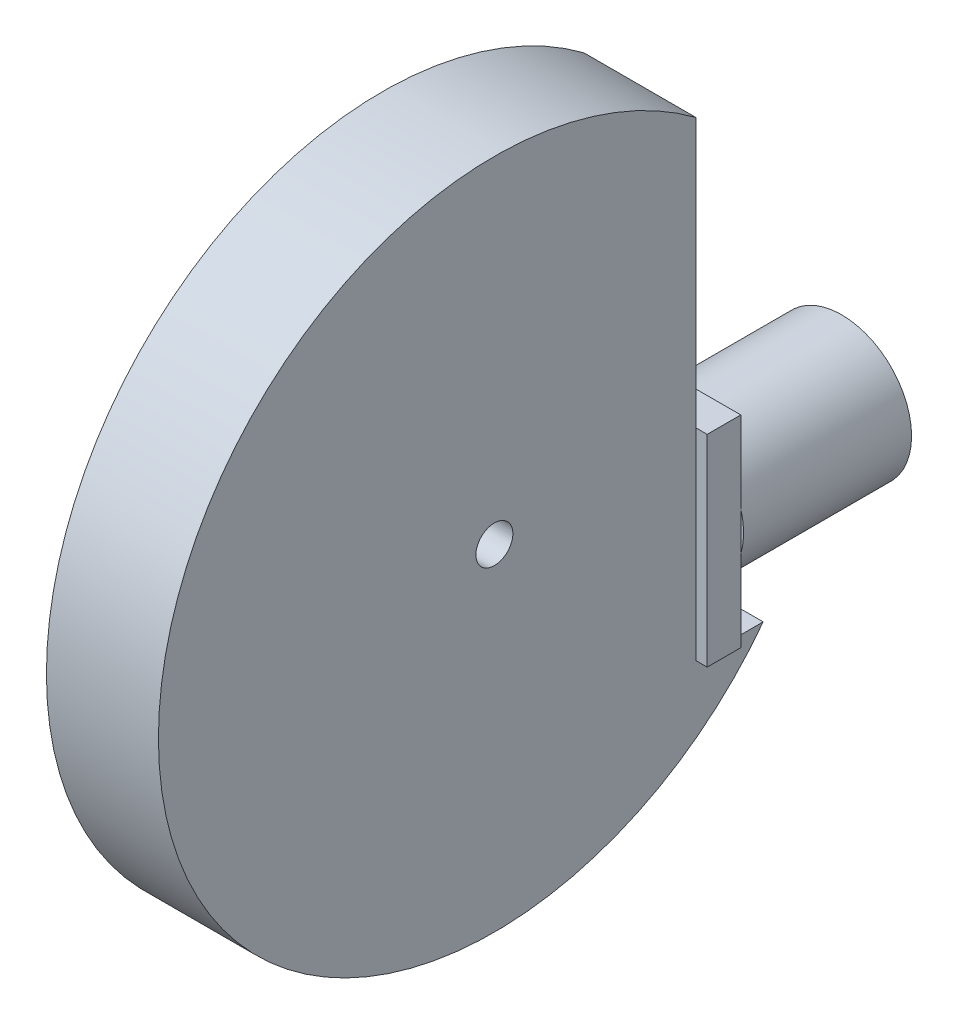
ISO-10303-21;
HEADER;
FILE_DESCRIPTION(('STEP AP214'),'2;1');
FILE_NAME('part.step','',(''),(''),'','','');
FILE_SCHEMA(('AUTOMOTIVE_DESIGN { 1 0 10303 214 1 1 1 1 }'));
ENDSEC;
DATA;
#1=APPLICATION_CONTEXT('core data for automotive mechanical design processes');
#2=APPLICATION_PROTOCOL_DEFINITION('international standard','automotive_design',2000,#1);
#3=PRODUCT_CONTEXT('',#1,'mechanical');
#4=PRODUCT('Part','Part','',(#3));
#5=PRODUCT_RELATED_PRODUCT_CATEGORY('part','',(#4));
#6=PRODUCT_DEFINITION_FORMATION('','',#4);
#7=PRODUCT_DEFINITION_CONTEXT('part definition',#1,'design');
#8=PRODUCT_DEFINITION('design','',#6,#7);
#9=PRODUCT_DEFINITION_SHAPE('','',#8);
#10=(LENGTH_UNIT() NAMED_UNIT(*) SI_UNIT(.MILLI.,.METRE.));
#11=(NAMED_UNIT(*) PLANE_ANGLE_UNIT() SI_UNIT($,.RADIAN.));
#12=(NAMED_UNIT(*) SI_UNIT($,.STERADIAN.) SOLID_ANGLE_UNIT());
#13=UNCERTAINTY_MEASURE_WITH_UNIT(LENGTH_MEASURE(1.E-05),#10,'distance_accuracy_value','');
#14=(GEOMETRIC_REPRESENTATION_CONTEXT(3) GLOBAL_UNCERTAINTY_ASSIGNED_CONTEXT((#13)) GLOBAL_UNIT_ASSIGNED_CONTEXT((#10,
#11,#12)) REPRESENTATION_CONTEXT('',''));
#15=CARTESIAN_POINT('',(0.,0.,0.));
#16=DIRECTION('',(0.,0.,1.));
#17=DIRECTION('',(1.,0.,0.));
#18=AXIS2_PLACEMENT_3D('',#15,#16,#17);
#19=CARTESIAN_POINT('',(-6.,-9.,18.));
#20=DIRECTION('',(0.,1.,0.));
#21=DIRECTION('',(0.,0.,1.));
#22=AXIS2_PLACEMENT_3D('',#19,#20,#21);
#23=PLANE('',#22);
#24=DIRECTION('',(0.,0.,1.));
#25=VECTOR('',#24,1.);
#26=CARTESIAN_POINT('',(-5.,-9.,12.));
#27=LINE('',#26,#25);
#28=CARTESIAN_POINT('',(-5.,-9.00000000000001,15.));
#29=VERTEX_POINT('',#28);
#30=CARTESIAN_POINT('',(-5.,-9.00000000000001,18.));
#31=VERTEX_POINT('',#30);
#32=EDGE_CURVE('E248',#29,#31,#27,.T.);
#33=ORIENTED_EDGE('',*,*,#32,.T.);
#34=DIRECTION('',(1.,0.,0.));
#35=VECTOR('',#34,1.);
#36=CARTESIAN_POINT('',(-6.,-9.,18.));
#37=LINE('',#36,#35);
#38=CARTESIAN_POINT('',(-6.,-9.,18.));
#39=VERTEX_POINT('',#38);
#40=EDGE_CURVE('E160',#39,#31,#37,.T.);
#41=ORIENTED_EDGE('',*,*,#40,.F.);
#42=DIRECTION('',(0.,0.,-1.));
#43=VECTOR('',#42,1.);
#44=CARTESIAN_POINT('',(-6.,-9.,18.));
#45=LINE('',#44,#43);
#46=CARTESIAN_POINT('',(-6.,-9.,15.));
#47=VERTEX_POINT('',#46);
#48=EDGE_CURVE('E176',#39,#47,#45,.T.);
#49=ORIENTED_EDGE('',*,*,#48,.T.);
#50=DIRECTION('',(1.,0.,0.));
#51=VECTOR('',#50,1.);
#52=CARTESIAN_POINT('',(-6.,-9.,15.));
#53=LINE('',#52,#51);
#54=EDGE_CURVE('E152',#47,#29,#53,.T.);
#55=ORIENTED_EDGE('',*,*,#54,.T.);
#56=EDGE_LOOP('',(#33,#41,#49,#55));
#57=FACE_BOUND('',#56,.T.);
#58=ADVANCED_FACE('F33',(#57),#23,.F.);
#59=CARTESIAN_POINT('',(0.,0.,18.));
#60=DIRECTION('',(0.,0.,1.));
#61=DIRECTION('',(1.,0.,0.));
#62=AXIS2_PLACEMENT_3D('',#59,#60,#61);
#63=PLANE('',#62);
#64=ORIENTED_EDGE('',*,*,#40,.T.);
#65=DIRECTION('',(0.,1.,0.));
#66=VECTOR('',#65,1.);
#67=CARTESIAN_POINT('',(-5.,9.,18.));
#68=LINE('',#67,#66);
#69=CARTESIAN_POINT('',(-5.,9.,18.));
#70=VERTEX_POINT('',#69);
#71=EDGE_CURVE('E129',#31,#70,#68,.T.);
#72=ORIENTED_EDGE('',*,*,#71,.T.);
#73=DIRECTION('',(-1.,0.,0.));
#74=VECTOR('',#73,1.);
#75=CARTESIAN_POINT('',(-6.,9.,18.));
#76=LINE('',#75,#74);
#77=CARTESIAN_POINT('',(-6.,9.,18.));
#78=VERTEX_POINT('',#77);
#79=EDGE_CURVE('E151',#70,#78,#76,.T.);
#80=ORIENTED_EDGE('',*,*,#79,.T.);
#81=DIRECTION('',(0.,-1.,0.));
#82=VECTOR('',#81,1.);
#83=CARTESIAN_POINT('',(-6.,9.,18.));
#84=LINE('',#83,#82);
#85=EDGE_CURVE('E156',#78,#39,#84,.T.);
#86=ORIENTED_EDGE('',*,*,#85,.T.);
#87=EDGE_LOOP('',(#64,#72,#80,#86));
#88=FACE_BOUND('',#87,.T.);
#89=ADVANCED_FACE('F213',(#88),#63,.T.);
#90=CARTESIAN_POINT('',(0.,0.,15.));
#91=DIRECTION('',(0.,0.,1.));
#92=DIRECTION('',(1.,0.,0.));
#93=AXIS2_PLACEMENT_3D('',#90,#91,#92);
#94=PLANE('',#93);
#95=DIRECTION('',(0.,1.,0.));
#96=VECTOR('',#95,1.);
#97=CARTESIAN_POINT('',(6.,9.,15.));
#98=LINE('',#97,#96);
#99=CARTESIAN_POINT('',(6.,-1.74999999999999,15.));
#100=VERTEX_POINT('',#99);
#101=CARTESIAN_POINT('',(6.,1.74999999999999,15.));
#102=VERTEX_POINT('',#101);
#103=EDGE_CURVE('E11',#100,#102,#98,.T.);
#104=ORIENTED_EDGE('',*,*,#103,.F.);
#105=CARTESIAN_POINT('',(0.,0.,15.));
#106=DIRECTION('',(0.,0.,1.));
#107=DIRECTION('',(1.,0.,0.));
#108=AXIS2_PLACEMENT_3D('',#105,#106,#107);
#109=CIRCLE('',#108,6.25);
#110=EDGE_CURVE('E187',#100,#102,#109,.T.);
#111=ORIENTED_EDGE('',*,*,#110,.T.);
#112=EDGE_LOOP('',(#104,#111));
#113=FACE_BOUND('',#112,.T.);
#114=ADVANCED_FACE('F211',(#113),#94,.T.);
#115=CARTESIAN_POINT('',(0.,0.,15.));
#116=DIRECTION('',(0.,0.,-1.));
#117=DIRECTION('',(-1.,0.,0.));
#118=AXIS2_PLACEMENT_3D('',#115,#116,#117);
#119=CYLINDRICAL_SURFACE('',#118,6.25);
#120=CARTESIAN_POINT('',(-6.,1.75000000000001,15.));
#121=VERTEX_POINT('',#120);
#122=EDGE_CURVE('E184',#102,#121,#109,.T.);
#123=ORIENTED_EDGE('',*,*,#122,.F.);
#124=ORIENTED_EDGE('',*,*,#110,.F.);
#125=CARTESIAN_POINT('',(-6.,-1.75000000000001,15.));
#126=VERTEX_POINT('',#125);
#127=EDGE_CURVE('E193',#126,#100,#109,.T.);
#128=ORIENTED_EDGE('',*,*,#127,.F.);
#129=EDGE_CURVE('E186',#121,#126,#109,.T.);
#130=ORIENTED_EDGE('',*,*,#129,.F.);
#131=EDGE_LOOP('',(#123,#124,#128,#130));
#132=FACE_BOUND('',#131,.T.);
#133=CARTESIAN_POINT('',(0.,0.,0.));
#134=DIRECTION('',(0.,0.,1.));
#135=DIRECTION('',(1.,0.,0.));
#136=AXIS2_PLACEMENT_3D('',#133,#134,#135);
#137=CIRCLE('',#136,6.25);
#138=CARTESIAN_POINT('',(6.25,0.,0.));
#139=VERTEX_POINT('',#138);
#140=EDGE_CURVE('E37',#139,#139,#137,.T.);
#141=ORIENTED_EDGE('',*,*,#140,.T.);
#142=EDGE_LOOP('',(#141));
#143=FACE_BOUND('',#142,.T.);
#144=ADVANCED_FACE('F35',(#132,#143),#119,.T.);
#145=DIRECTION('',(0.,-1.,0.));
#146=VECTOR('',#145,1.);
#147=CARTESIAN_POINT('',(-6.,9.,15.));
#148=LINE('',#147,#146);
#149=EDGE_CURVE('E42',#121,#126,#148,.T.);
#150=ORIENTED_EDGE('',*,*,#149,.F.);
#151=ORIENTED_EDGE('',*,*,#129,.T.);
#152=EDGE_LOOP('',(#150,#151));
#153=FACE_BOUND('',#152,.T.);
#154=ADVANCED_FACE('F202',(#153),#94,.T.);
#155=CARTESIAN_POINT('',(0.,0.,0.));
#156=DIRECTION('',(0.,0.,1.));
#157=DIRECTION('',(1.,0.,0.));
#158=AXIS2_PLACEMENT_3D('',#155,#156,#157);
#159=PLANE('',#158);
#160=ORIENTED_EDGE('',*,*,#140,.F.);
#161=EDGE_LOOP('',(#160));
#162=FACE_BOUND('',#161,.T.);
#163=ADVANCED_FACE('F199',(#162),#159,.F.);
#164=CARTESIAN_POINT('',(0.,0.,15.));
#165=DIRECTION('',(0.,0.,1.));
#166=DIRECTION('',(1.,0.,0.));
#167=AXIS2_PLACEMENT_3D('',#164,#165,#166);
#168=PLANE('',#167);
#169=CARTESIAN_POINT('',(6.,9.,15.));
#170=VERTEX_POINT('',#169);
#171=EDGE_CURVE('E45',#102,#170,#98,.T.);
#172=ORIENTED_EDGE('',*,*,#171,.F.);
#173=ORIENTED_EDGE('',*,*,#122,.T.);
#174=CARTESIAN_POINT('',(-6.,9.,15.));
#175=VERTEX_POINT('',#174);
#176=EDGE_CURVE('E168',#175,#121,#148,.T.);
#177=ORIENTED_EDGE('',*,*,#176,.F.);
#178=DIRECTION('',(-1.,0.,0.));
#179=VECTOR('',#178,1.);
#180=CARTESIAN_POINT('',(-6.,9.,15.));
#181=LINE('',#180,#179);
#182=EDGE_CURVE('E165',#170,#175,#181,.T.);
#183=ORIENTED_EDGE('',*,*,#182,.F.);
#184=EDGE_LOOP('',(#172,#173,#177,#183));
#185=FACE_BOUND('',#184,.T.);
#186=ADVANCED_FACE('F201',(#185),#168,.F.);
#187=EDGE_CURVE('E167',#126,#47,#148,.T.);
#188=ORIENTED_EDGE('',*,*,#187,.F.);
#189=ORIENTED_EDGE('',*,*,#127,.T.);
#190=CARTESIAN_POINT('',(6.,-9.,15.));
#191=VERTEX_POINT('',#190);
#192=EDGE_CURVE('E44',#191,#100,#98,.T.);
#193=ORIENTED_EDGE('',*,*,#192,.F.);
#194=CARTESIAN_POINT('',(5.,-9.00000000000001,15.));
#195=VERTEX_POINT('',#194);
#196=EDGE_CURVE('E171',#195,#191,#53,.T.);
#197=ORIENTED_EDGE('',*,*,#196,.F.);
#198=DIRECTION('',(1.,0.,0.));
#199=VECTOR('',#198,1.);
#200=CARTESIAN_POINT('',(0.,-9.00000000000001,15.));
#201=LINE('',#200,#199);
#202=EDGE_CURVE('E141',#29,#195,#201,.T.);
#203=ORIENTED_EDGE('',*,*,#202,.F.);
#204=ORIENTED_EDGE('',*,*,#54,.F.);
#205=EDGE_LOOP('',(#188,#189,#193,#197,#203,#204));
#206=FACE_BOUND('',#205,.T.);
#207=ADVANCED_FACE('F207',(#206),#168,.F.);
#208=CARTESIAN_POINT('',(6.,9.,18.));
#209=DIRECTION('',(-1.,0.,0.));
#210=DIRECTION('',(0.,-1.,0.));
#211=AXIS2_PLACEMENT_3D('',#208,#209,#210);
#212=PLANE('',#211);
#213=ORIENTED_EDGE('',*,*,#192,.T.);
#214=ORIENTED_EDGE('',*,*,#103,.T.);
#215=ORIENTED_EDGE('',*,*,#171,.T.);
#216=DIRECTION('',(0.,0.,-1.));
#217=VECTOR('',#216,1.);
#218=CARTESIAN_POINT('',(6.,9.,18.));
#219=LINE('',#218,#217);
#220=CARTESIAN_POINT('',(6.,9.,18.));
#221=VERTEX_POINT('',#220);
#222=EDGE_CURVE('E182',#221,#170,#219,.T.);
#223=ORIENTED_EDGE('',*,*,#222,.F.);
#224=DIRECTION('',(0.,1.,0.));
#225=VECTOR('',#224,1.);
#226=CARTESIAN_POINT('',(6.,9.,18.));
#227=LINE('',#226,#225);
#228=CARTESIAN_POINT('',(6.,-9.,18.));
#229=VERTEX_POINT('',#228);
#230=EDGE_CURVE('E148',#229,#221,#227,.T.);
#231=ORIENTED_EDGE('',*,*,#230,.F.);
#232=DIRECTION('',(0.,0.,-1.));
#233=VECTOR('',#232,1.);
#234=CARTESIAN_POINT('',(6.,-9.,18.));
#235=LINE('',#234,#233);
#236=EDGE_CURVE('E162',#229,#191,#235,.T.);
#237=ORIENTED_EDGE('',*,*,#236,.T.);
#238=EDGE_LOOP('',(#213,#214,#215,#223,#231,#237));
#239=FACE_BOUND('',#238,.T.);
#240=ADVANCED_FACE('F271',(#239),#212,.F.);
#241=CARTESIAN_POINT('',(-6.,9.,18.));
#242=DIRECTION('',(0.,-1.,0.));
#243=DIRECTION('',(0.,0.,-1.));
#244=AXIS2_PLACEMENT_3D('',#241,#242,#243);
#245=PLANE('',#244);
#246=ORIENTED_EDGE('',*,*,#182,.T.);
#247=DIRECTION('',(0.,0.,-1.));
#248=VECTOR('',#247,1.);
#249=CARTESIAN_POINT('',(-6.,9.,18.));
#250=LINE('',#249,#248);
#251=EDGE_CURVE('E179',#78,#175,#250,.T.);
#252=ORIENTED_EDGE('',*,*,#251,.F.);
#253=ORIENTED_EDGE('',*,*,#79,.F.);
#254=CARTESIAN_POINT('',(5.,9.,18.));
#255=VERTEX_POINT('',#254);
#256=EDGE_CURVE('E157',#255,#70,#76,.T.);
#257=ORIENTED_EDGE('',*,*,#256,.F.);
#258=EDGE_CURVE('E153',#221,#255,#76,.T.);
#259=ORIENTED_EDGE('',*,*,#258,.F.);
#260=ORIENTED_EDGE('',*,*,#222,.T.);
#261=EDGE_LOOP('',(#246,#252,#253,#257,#259,#260));
#262=FACE_BOUND('',#261,.T.);
#263=ADVANCED_FACE('F233',(#262),#245,.F.);
#264=CARTESIAN_POINT('',(-6.,9.,18.));
#265=DIRECTION('',(1.,0.,0.));
#266=DIRECTION('',(0.,1.,0.));
#267=AXIS2_PLACEMENT_3D('',#264,#265,#266);
#268=PLANE('',#267);
#269=ORIENTED_EDGE('',*,*,#176,.T.);
#270=ORIENTED_EDGE('',*,*,#149,.T.);
#271=ORIENTED_EDGE('',*,*,#187,.T.);
#272=ORIENTED_EDGE('',*,*,#48,.F.);
#273=ORIENTED_EDGE('',*,*,#85,.F.);
#274=ORIENTED_EDGE('',*,*,#251,.T.);
#275=EDGE_LOOP('',(#269,#270,#271,#272,#273,#274));
#276=FACE_BOUND('',#275,.T.);
#277=ADVANCED_FACE('F226',(#276),#268,.F.);
#278=CARTESIAN_POINT('',(5.,-9.00000000000001,18.));
#279=VERTEX_POINT('',#278);
#280=EDGE_CURVE('E159',#279,#229,#37,.T.);
#281=ORIENTED_EDGE('',*,*,#280,.F.);
#282=DIRECTION('',(0.,0.,1.));
#283=VECTOR('',#282,1.);
#284=CARTESIAN_POINT('',(5.,-9.,12.));
#285=LINE('',#284,#283);
#286=EDGE_CURVE('E138',#195,#279,#285,.T.);
#287=ORIENTED_EDGE('',*,*,#286,.F.);
#288=ORIENTED_EDGE('',*,*,#196,.T.);
#289=ORIENTED_EDGE('',*,*,#236,.F.);
#290=EDGE_LOOP('',(#281,#287,#288,#289));
#291=FACE_BOUND('',#290,.T.);
#292=ADVANCED_FACE('F216',(#291),#23,.F.);
#293=DIRECTION('',(0.,1.,0.));
#294=VECTOR('',#293,1.);
#295=CARTESIAN_POINT('',(5.,33.,18.));
#296=LINE('',#295,#294);
#297=EDGE_CURVE('E125',#279,#255,#296,.T.);
#298=ORIENTED_EDGE('',*,*,#297,.F.);
#299=ORIENTED_EDGE('',*,*,#280,.T.);
#300=ORIENTED_EDGE('',*,*,#230,.T.);
#301=ORIENTED_EDGE('',*,*,#258,.T.);
#302=EDGE_LOOP('',(#298,#299,#300,#301));
#303=FACE_BOUND('',#302,.T.);
#304=ADVANCED_FACE('F222',(#303),#63,.T.);
#305=CARTESIAN_POINT('',(5.,9.,18.));
#306=DIRECTION('',(0.,0.,1.));
#307=DIRECTION('',(0.,-1.,0.));
#308=AXIS2_PLACEMENT_3D('',#305,#306,#307);
#309=PLANE('',#308);
#310=CARTESIAN_POINT('',(5.,33.,18.));
#311=VERTEX_POINT('',#310);
#312=EDGE_CURVE('E117',#255,#311,#296,.T.);
#313=ORIENTED_EDGE('',*,*,#312,.F.);
#314=ORIENTED_EDGE('',*,*,#256,.T.);
#315=CARTESIAN_POINT('',(-5.,33.,18.));
#316=VERTEX_POINT('',#315);
#317=EDGE_CURVE('E52',#70,#316,#68,.T.);
#318=ORIENTED_EDGE('',*,*,#317,.T.);
#319=DIRECTION('',(-1.,0.,0.));
#320=VECTOR('',#319,1.);
#321=CARTESIAN_POINT('',(5.,33.,18.));
#322=LINE('',#321,#320);
#323=EDGE_CURVE('E134',#311,#316,#322,.T.);
#324=ORIENTED_EDGE('',*,*,#323,.F.);
#325=EDGE_LOOP('',(#313,#314,#318,#324));
#326=FACE_BOUND('',#325,.T.);
#327=ADVANCED_FACE('F140',(#326),#309,.F.);
#328=CARTESIAN_POINT('',(5.,-9.,12.));
#329=DIRECTION('',(0.,-1.,0.));
#330=DIRECTION('',(0.,0.,-1.));
#331=AXIS2_PLACEMENT_3D('',#328,#329,#330);
#332=PLANE('',#331);
#333=CARTESIAN_POINT('',(-5.,-9.,12.));
#334=VERTEX_POINT('',#333);
#335=EDGE_CURVE('E250',#334,#29,#27,.T.);
#336=ORIENTED_EDGE('',*,*,#335,.T.);
#337=ORIENTED_EDGE('',*,*,#202,.T.);
#338=CARTESIAN_POINT('',(5.,-9.,12.));
#339=VERTEX_POINT('',#338);
#340=EDGE_CURVE('E144',#339,#195,#285,.T.);
#341=ORIENTED_EDGE('',*,*,#340,.F.);
#342=DIRECTION('',(-1.,0.,0.));
#343=VECTOR('',#342,1.);
#344=CARTESIAN_POINT('',(5.,-9.,12.));
#345=LINE('',#344,#343);
#346=EDGE_CURVE('E136',#339,#334,#345,.T.);
#347=ORIENTED_EDGE('',*,*,#346,.T.);
#348=EDGE_LOOP('',(#336,#337,#341,#347));
#349=FACE_BOUND('',#348,.T.);
#350=ADVANCED_FACE('F267',(#349),#332,.F.);
#351=CARTESIAN_POINT('',(5.,9.,36.));
#352=DIRECTION('',(1.,0.,0.));
#353=DIRECTION('',(0.,0.,-1.));
#354=AXIS2_PLACEMENT_3D('',#351,#352,#353);
#355=PLANE('',#354);
#356=ORIENTED_EDGE('',*,*,#297,.T.);
#357=ORIENTED_EDGE('',*,*,#312,.T.);
#358=CARTESIAN_POINT('',(5.,9.,36.));
#359=DIRECTION('',(1.,0.,0.));
#360=DIRECTION('',(0.,0.,-1.));
#361=AXIS2_PLACEMENT_3D('',#358,#359,#360);
#362=CIRCLE('',#361,30.);
#363=EDGE_CURVE('E122',#311,#339,#362,.T.);
#364=ORIENTED_EDGE('',*,*,#363,.T.);
#365=ORIENTED_EDGE('',*,*,#340,.T.);
#366=ORIENTED_EDGE('',*,*,#286,.T.);
#367=EDGE_LOOP('',(#356,#357,#364,#365,#366));
#368=FACE_BOUND('',#367,.T.);
#369=CARTESIAN_POINT('',(5.,9.,36.));
#370=DIRECTION('',(1.,0.,0.));
#371=DIRECTION('',(0.,0.,-1.));
#372=AXIS2_PLACEMENT_3D('',#369,#370,#371);
#373=CIRCLE('',#372,1.65);
#374=CARTESIAN_POINT('',(5.,9.,34.35));
#375=VERTEX_POINT('',#374);
#376=EDGE_CURVE('E249',#375,#375,#373,.T.);
#377=ORIENTED_EDGE('',*,*,#376,.F.);
#378=EDGE_LOOP('',(#377));
#379=FACE_BOUND('',#378,.T.);
#380=ADVANCED_FACE('F119',(#368,#379),#355,.T.);
#381=CARTESIAN_POINT('',(-5.,9.,36.));
#382=DIRECTION('',(1.,0.,0.));
#383=DIRECTION('',(0.,0.,-1.));
#384=AXIS2_PLACEMENT_3D('',#381,#382,#383);
#385=PLANE('',#384);
#386=CARTESIAN_POINT('',(-5.,9.,36.));
#387=DIRECTION('',(1.,0.,0.));
#388=DIRECTION('',(0.,0.,-1.));
#389=AXIS2_PLACEMENT_3D('',#386,#387,#388);
#390=CIRCLE('',#389,30.);
#391=EDGE_CURVE('E246',#316,#334,#390,.T.);
#392=ORIENTED_EDGE('',*,*,#391,.F.);
#393=ORIENTED_EDGE('',*,*,#317,.F.);
#394=ORIENTED_EDGE('',*,*,#71,.F.);
#395=ORIENTED_EDGE('',*,*,#32,.F.);
#396=ORIENTED_EDGE('',*,*,#335,.F.);
#397=EDGE_LOOP('',(#392,#393,#394,#395,#396));
#398=FACE_BOUND('',#397,.T.);
#399=CARTESIAN_POINT('',(-5.,9.,36.));
#400=DIRECTION('',(1.,0.,0.));
#401=DIRECTION('',(0.,0.,-1.));
#402=AXIS2_PLACEMENT_3D('',#399,#400,#401);
#403=CIRCLE('',#402,1.65);
#404=CARTESIAN_POINT('',(-5.,9.,34.35));
#405=VERTEX_POINT('',#404);
#406=EDGE_CURVE('E242',#405,#405,#403,.T.);
#407=ORIENTED_EDGE('',*,*,#406,.T.);
#408=EDGE_LOOP('',(#407));
#409=FACE_BOUND('',#408,.T.);
#410=ADVANCED_FACE('F263',(#398,#409),#385,.F.);
#411=CARTESIAN_POINT('',(5.,9.,36.));
#412=DIRECTION('',(-1.,0.,0.));
#413=DIRECTION('',(0.,0.,1.));
#414=AXIS2_PLACEMENT_3D('',#411,#412,#413);
#415=CYLINDRICAL_SURFACE('',#414,30.);
#416=ORIENTED_EDGE('',*,*,#391,.T.);
#417=ORIENTED_EDGE('',*,*,#346,.F.);
#418=ORIENTED_EDGE('',*,*,#363,.F.);
#419=ORIENTED_EDGE('',*,*,#323,.T.);
#420=EDGE_LOOP('',(#416,#417,#418,#419));
#421=FACE_BOUND('',#420,.T.);
#422=ADVANCED_FACE('F133',(#421),#415,.T.);
#423=CARTESIAN_POINT('',(5.,9.,36.));
#424=DIRECTION('',(-1.,0.,0.));
#425=DIRECTION('',(0.,0.,1.));
#426=AXIS2_PLACEMENT_3D('',#423,#424,#425);
#427=CYLINDRICAL_SURFACE('',#426,1.65);
#428=ORIENTED_EDGE('',*,*,#376,.T.);
#429=EDGE_LOOP('',(#428));
#430=FACE_BOUND('',#429,.T.);
#431=ORIENTED_EDGE('',*,*,#406,.F.);
#432=EDGE_LOOP('',(#431));
#433=FACE_BOUND('',#432,.T.);
#434=ADVANCED_FACE('F350',(#430,#433),#427,.F.);
#435=CLOSED_SHELL('',(#58,#89,#114,#144,#154,#163,#186,#207,#240,#263,#277,#292,#304,#327,#350,
#380,#410,#422,#434));
#436=MANIFOLD_SOLID_BREP('B2',#435);
#437=ADVANCED_BREP_SHAPE_REPRESENTATION('',(#18,#436),#14);
#438=SHAPE_DEFINITION_REPRESENTATION(#9,#437);
ENDSEC;
END-ISO-10303-21;
